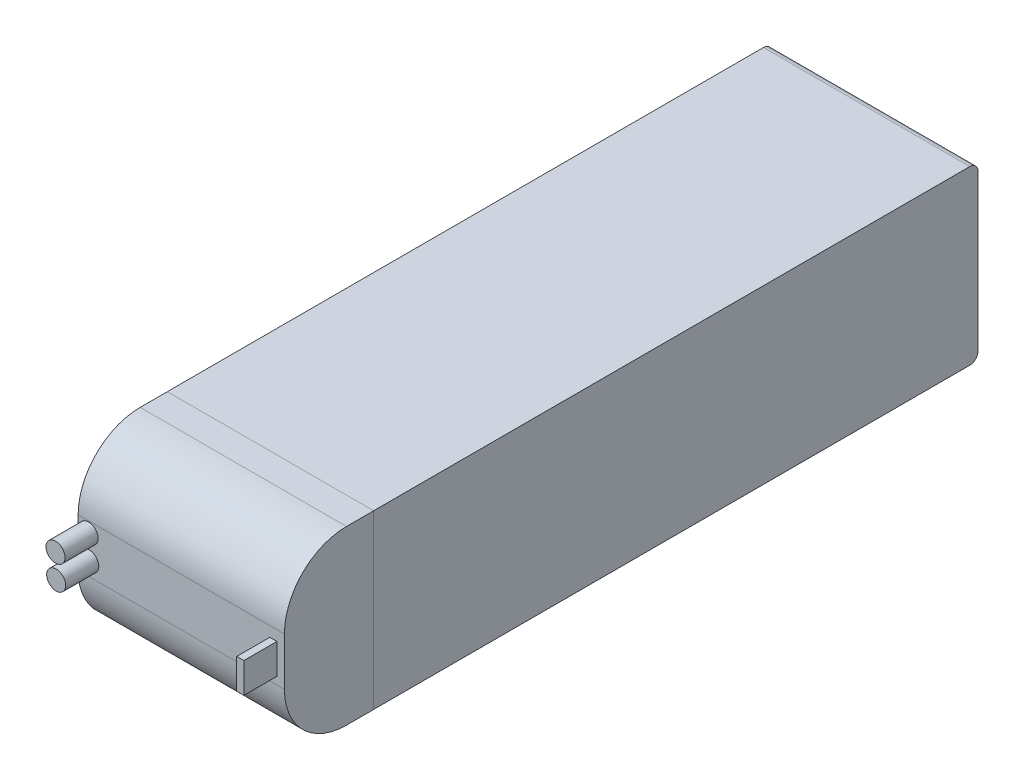
ISO-10303-21;
HEADER;
FILE_DESCRIPTION(('STEP AP214'),'2;1');
FILE_NAME('part.step','',(''),(''),'','','');
FILE_SCHEMA(('AUTOMOTIVE_DESIGN { 1 0 10303 214 1 1 1 1 }'));
ENDSEC;
DATA;
#1=APPLICATION_CONTEXT('core data for automotive mechanical design processes');
#2=APPLICATION_PROTOCOL_DEFINITION('international standard','automotive_design',2000,#1);
#3=PRODUCT_CONTEXT('',#1,'mechanical');
#4=PRODUCT('Part','Part','',(#3));
#5=PRODUCT_RELATED_PRODUCT_CATEGORY('part','',(#4));
#6=PRODUCT_DEFINITION_FORMATION('','',#4);
#7=PRODUCT_DEFINITION_CONTEXT('part definition',#1,'design');
#8=PRODUCT_DEFINITION('design','',#6,#7);
#9=PRODUCT_DEFINITION_SHAPE('','',#8);
#10=(LENGTH_UNIT() NAMED_UNIT(*) SI_UNIT(.MILLI.,.METRE.));
#11=(NAMED_UNIT(*) PLANE_ANGLE_UNIT() SI_UNIT($,.RADIAN.));
#12=(NAMED_UNIT(*) SI_UNIT($,.STERADIAN.) SOLID_ANGLE_UNIT());
#13=UNCERTAINTY_MEASURE_WITH_UNIT(LENGTH_MEASURE(1.E-05),#10,'distance_accuracy_value','');
#14=(GEOMETRIC_REPRESENTATION_CONTEXT(3) GLOBAL_UNCERTAINTY_ASSIGNED_CONTEXT((#13)) GLOBAL_UNIT_ASSIGNED_CONTEXT((#10,
#11,#12)) REPRESENTATION_CONTEXT('',''));
#15=CARTESIAN_POINT('',(0.,0.,0.));
#16=DIRECTION('',(0.,0.,1.));
#17=DIRECTION('',(1.,0.,0.));
#18=AXIS2_PLACEMENT_3D('',#15,#16,#17);
#19=CARTESIAN_POINT('',(0.,0.,94.625));
#20=DIRECTION('',(0.,0.,1.));
#21=DIRECTION('',(1.,0.,0.));
#22=AXIS2_PLACEMENT_3D('',#19,#20,#21);
#23=PLANE('',#22);
#24=CARTESIAN_POINT('',(-22.2263601289547,18.3127947682551,94.625));
#25=DIRECTION('',(0.,0.,1.));
#26=DIRECTION('',(1.,0.,0.));
#27=AXIS2_PLACEMENT_3D('',#24,#25,#26);
#28=CIRCLE('',#27,2.305);
#29=CARTESIAN_POINT('',(-19.9213601289547,18.3127947682551,94.625));
#30=VERTEX_POINT('',#29);
#31=EDGE_CURVE('E195',#30,#30,#28,.T.);
#32=ORIENTED_EDGE('',*,*,#31,.F.);
#33=EDGE_LOOP('',(#32));
#34=FACE_BOUND('',#33,.T.);
#35=CARTESIAN_POINT('',(-22.3821375346887,24.0765587804127,94.625));
#36=DIRECTION('',(0.,0.,1.));
#37=DIRECTION('',(1.,0.,0.));
#38=AXIS2_PLACEMENT_3D('',#35,#36,#37);
#39=CIRCLE('',#38,2.305);
#40=CARTESIAN_POINT('',(-20.0771375346887,24.0765587804127,94.625));
#41=VERTEX_POINT('',#40);
#42=EDGE_CURVE('E208',#41,#41,#39,.T.);
#43=ORIENTED_EDGE('',*,*,#42,.F.);
#44=EDGE_LOOP('',(#43));
#45=FACE_BOUND('',#44,.T.);
#46=DIRECTION('',(0.,-1.,0.));
#47=VECTOR('',#46,1.);
#48=CARTESIAN_POINT('',(-24.913270920856,0.0104665199967546,94.625));
#49=LINE('',#48,#47);
#50=CARTESIAN_POINT('',(-24.913270920856,26.6104665199968,94.625));
#51=VERTEX_POINT('',#50);
#52=CARTESIAN_POINT('',(-24.913270920856,15.0104665199968,94.625));
#53=VERTEX_POINT('',#52);
#54=EDGE_CURVE('E218',#51,#53,#49,.T.);
#55=ORIENTED_EDGE('',*,*,#54,.T.);
#56=DIRECTION('',(1.,0.,0.));
#57=VECTOR('',#56,1.);
#58=CARTESIAN_POINT('',(24.956729079144,15.0104665199968,94.625));
#59=LINE('',#58,#57);
#60=CARTESIAN_POINT('',(24.956729079144,15.0104665199968,94.625));
#61=VERTEX_POINT('',#60);
#62=EDGE_CURVE('E296',#53,#61,#59,.T.);
#63=ORIENTED_EDGE('',*,*,#62,.T.);
#64=DIRECTION('',(0.,1.,0.));
#65=VECTOR('',#64,1.);
#66=CARTESIAN_POINT('',(24.956729079144,0.0104665199967607,94.625));
#67=LINE('',#66,#65);
#68=CARTESIAN_POINT('',(24.956729079144,26.6104665199968,94.625));
#69=VERTEX_POINT('',#68);
#70=EDGE_CURVE('E222',#61,#69,#67,.T.);
#71=ORIENTED_EDGE('',*,*,#70,.T.);
#72=DIRECTION('',(-1.,0.,0.));
#73=VECTOR('',#72,1.);
#74=CARTESIAN_POINT('',(-24.913270920856,26.6104665199968,94.625));
#75=LINE('',#74,#73);
#76=EDGE_CURVE('E292',#69,#51,#75,.T.);
#77=ORIENTED_EDGE('',*,*,#76,.T.);
#78=EDGE_LOOP('',(#55,#63,#71,#77));
#79=FACE_BOUND('',#78,.T.);
#80=DIRECTION('',(-1.,0.,0.));
#81=VECTOR('',#80,1.);
#82=CARTESIAN_POINT('',(21.4270335595322,24.143678448531,94.625));
#83=LINE('',#82,#81);
#84=CARTESIAN_POINT('',(23.1470335595322,24.143678448531,94.625));
#85=VERTEX_POINT('',#84);
#86=CARTESIAN_POINT('',(21.4270335595322,24.143678448531,94.625));
#87=VERTEX_POINT('',#86);
#88=EDGE_CURVE('E445',#85,#87,#83,.T.);
#89=ORIENTED_EDGE('',*,*,#88,.F.);
#90=DIRECTION('',(0.,1.,0.));
#91=VECTOR('',#90,1.);
#92=CARTESIAN_POINT('',(23.1470335595322,24.143678448531,94.625));
#93=LINE('',#92,#91);
#94=CARTESIAN_POINT('',(23.1470335595322,16.843678448531,94.625));
#95=VERTEX_POINT('',#94);
#96=EDGE_CURVE('E192',#95,#85,#93,.T.);
#97=ORIENTED_EDGE('',*,*,#96,.F.);
#98=DIRECTION('',(1.,0.,0.));
#99=VECTOR('',#98,1.);
#100=CARTESIAN_POINT('',(21.4270335595322,16.843678448531,94.625));
#101=LINE('',#100,#99);
#102=CARTESIAN_POINT('',(21.4270335595322,16.843678448531,94.625));
#103=VERTEX_POINT('',#102);
#104=EDGE_CURVE('E188',#103,#95,#101,.T.);
#105=ORIENTED_EDGE('',*,*,#104,.F.);
#106=DIRECTION('',(0.,-1.,0.));
#107=VECTOR('',#106,1.);
#108=CARTESIAN_POINT('',(21.4270335595322,24.143678448531,94.625));
#109=LINE('',#108,#107);
#110=EDGE_CURVE('E448',#87,#103,#109,.T.);
#111=ORIENTED_EDGE('',*,*,#110,.F.);
#112=EDGE_LOOP('',(#89,#97,#105,#111));
#113=FACE_BOUND('',#112,.T.);
#114=ADVANCED_FACE('F43',(#34,#45,#79,#113),#23,.T.);
#115=CARTESIAN_POINT('',(24.935,41.6,73.055));
#116=DIRECTION('',(0.,0.,-1.));
#117=DIRECTION('',(-1.,0.,0.));
#118=AXIS2_PLACEMENT_3D('',#115,#116,#117);
#119=PLANE('',#118);
#120=DIRECTION('',(0.,-1.,0.));
#121=VECTOR('',#120,1.);
#122=CARTESIAN_POINT('',(-24.913270920856,0.0104665199967546,73.055));
#123=LINE('',#122,#121);
#124=CARTESIAN_POINT('',(-24.913270920856,41.6,73.055));
#125=VERTEX_POINT('',#124);
#126=CARTESIAN_POINT('',(-24.913270920856,0.0104665199967546,73.055));
#127=VERTEX_POINT('',#126);
#128=EDGE_CURVE('E232',#125,#127,#123,.T.);
#129=ORIENTED_EDGE('',*,*,#128,.F.);
#130=DIRECTION('',(1.,0.,0.));
#131=VECTOR('',#130,1.);
#132=CARTESIAN_POINT('',(24.935,41.6,73.055));
#133=LINE('',#132,#131);
#134=CARTESIAN_POINT('',(-24.935,41.6,73.055));
#135=VERTEX_POINT('',#134);
#136=EDGE_CURVE('E261',#135,#125,#133,.T.);
#137=ORIENTED_EDGE('',*,*,#136,.F.);
#138=DIRECTION('',(0.,-1.,0.));
#139=VECTOR('',#138,1.);
#140=CARTESIAN_POINT('',(-24.935,41.6,73.055));
#141=LINE('',#140,#139);
#142=CARTESIAN_POINT('',(-24.935,0.,73.055));
#143=VERTEX_POINT('',#142);
#144=EDGE_CURVE('E288',#135,#143,#141,.T.);
#145=ORIENTED_EDGE('',*,*,#144,.T.);
#146=DIRECTION('',(1.,0.,0.));
#147=VECTOR('',#146,1.);
#148=CARTESIAN_POINT('',(24.935,0.,73.055));
#149=LINE('',#148,#147);
#150=CARTESIAN_POINT('',(24.935,0.,73.055));
#151=VERTEX_POINT('',#150);
#152=EDGE_CURVE('E271',#143,#151,#149,.T.);
#153=ORIENTED_EDGE('',*,*,#152,.T.);
#154=DIRECTION('',(0.,-1.,0.));
#155=VECTOR('',#154,1.);
#156=CARTESIAN_POINT('',(24.935,41.6,73.055));
#157=LINE('',#156,#155);
#158=CARTESIAN_POINT('',(24.935,0.0104665199967607,73.055));
#159=VERTEX_POINT('',#158);
#160=EDGE_CURVE('E284',#159,#151,#157,.T.);
#161=ORIENTED_EDGE('',*,*,#160,.F.);
#162=DIRECTION('',(1.,0.,0.));
#163=VECTOR('',#162,1.);
#164=CARTESIAN_POINT('',(24.956729079144,0.0104665199967607,73.055));
#165=LINE('',#164,#163);
#166=EDGE_CURVE('E233',#127,#159,#165,.T.);
#167=ORIENTED_EDGE('',*,*,#166,.F.);
#168=EDGE_LOOP('',(#129,#137,#145,#153,#161,#167));
#169=FACE_BOUND('',#168,.T.);
#170=ADVANCED_FACE('F352',(#169),#119,.F.);
#171=CARTESIAN_POINT('',(-24.935,41.6,73.055));
#172=DIRECTION('',(1.,0.,0.));
#173=DIRECTION('',(0.,0.,-1.));
#174=AXIS2_PLACEMENT_3D('',#171,#172,#173);
#175=PLANE('',#174);
#176=DIRECTION('',(0.,-1.,0.));
#177=VECTOR('',#176,1.);
#178=CARTESIAN_POINT('',(-24.935,41.6,-73.055));
#179=LINE('',#178,#177);
#180=CARTESIAN_POINT('',(-24.935,39.6,-73.055));
#181=VERTEX_POINT('',#180);
#182=CARTESIAN_POINT('',(-24.935,2.,-73.055));
#183=VERTEX_POINT('',#182);
#184=EDGE_CURVE('E268',#181,#183,#179,.T.);
#185=ORIENTED_EDGE('',*,*,#184,.T.);
#186=CARTESIAN_POINT('',(-24.935,2.,-71.055));
#187=DIRECTION('',(1.,0.,0.));
#188=DIRECTION('',(0.,0.,-1.));
#189=AXIS2_PLACEMENT_3D('',#186,#187,#188);
#190=CIRCLE('',#189,2.);
#191=CARTESIAN_POINT('',(-24.935,0.,-71.055));
#192=VERTEX_POINT('',#191);
#193=EDGE_CURVE('E328',#183,#192,#190,.F.);
#194=ORIENTED_EDGE('',*,*,#193,.T.);
#195=DIRECTION('',(0.,0.,1.));
#196=VECTOR('',#195,1.);
#197=CARTESIAN_POINT('',(-24.935,0.,73.055));
#198=LINE('',#197,#196);
#199=EDGE_CURVE('E255',#192,#143,#198,.T.);
#200=ORIENTED_EDGE('',*,*,#199,.T.);
#201=ORIENTED_EDGE('',*,*,#144,.F.);
#202=DIRECTION('',(0.,0.,1.));
#203=VECTOR('',#202,1.);
#204=CARTESIAN_POINT('',(-24.935,41.6,73.055));
#205=LINE('',#204,#203);
#206=CARTESIAN_POINT('',(-24.935,41.6,-71.055));
#207=VERTEX_POINT('',#206);
#208=EDGE_CURVE('E256',#207,#135,#205,.T.);
#209=ORIENTED_EDGE('',*,*,#208,.F.);
#210=CARTESIAN_POINT('',(-24.935,39.6,-71.055));
#211=DIRECTION('',(1.,0.,0.));
#212=DIRECTION('',(0.,0.,-1.));
#213=AXIS2_PLACEMENT_3D('',#210,#211,#212);
#214=CIRCLE('',#213,2.);
#215=EDGE_CURVE('E325',#207,#181,#214,.F.);
#216=ORIENTED_EDGE('',*,*,#215,.T.);
#217=EDGE_LOOP('',(#185,#194,#200,#201,#209,#216));
#218=FACE_BOUND('',#217,.T.);
#219=ADVANCED_FACE('F345',(#218),#175,.F.);
#220=CARTESIAN_POINT('',(24.935,41.6,73.055));
#221=DIRECTION('',(-1.,0.,0.));
#222=DIRECTION('',(0.,0.,1.));
#223=AXIS2_PLACEMENT_3D('',#220,#221,#222);
#224=PLANE('',#223);
#225=DIRECTION('',(0.,0.,-1.));
#226=VECTOR('',#225,1.);
#227=CARTESIAN_POINT('',(24.935,0.,73.055));
#228=LINE('',#227,#226);
#229=CARTESIAN_POINT('',(24.935,0.,-71.055));
#230=VERTEX_POINT('',#229);
#231=EDGE_CURVE('E260',#151,#230,#228,.T.);
#232=ORIENTED_EDGE('',*,*,#231,.T.);
#233=CARTESIAN_POINT('',(24.935,2.,-71.055));
#234=DIRECTION('',(-1.,0.,0.));
#235=DIRECTION('',(0.,0.,1.));
#236=AXIS2_PLACEMENT_3D('',#233,#234,#235);
#237=CIRCLE('',#236,2.);
#238=CARTESIAN_POINT('',(24.935,2.,-73.055));
#239=VERTEX_POINT('',#238);
#240=EDGE_CURVE('E52',#230,#239,#237,.F.);
#241=ORIENTED_EDGE('',*,*,#240,.T.);
#242=DIRECTION('',(0.,-1.,0.));
#243=VECTOR('',#242,1.);
#244=CARTESIAN_POINT('',(24.935,41.6,-73.055));
#245=LINE('',#244,#243);
#246=CARTESIAN_POINT('',(24.935,39.6,-73.055));
#247=VERTEX_POINT('',#246);
#248=EDGE_CURVE('E280',#247,#239,#245,.T.);
#249=ORIENTED_EDGE('',*,*,#248,.F.);
#250=CARTESIAN_POINT('',(24.935,39.6,-71.055));
#251=DIRECTION('',(-1.,0.,0.));
#252=DIRECTION('',(0.,0.,1.));
#253=AXIS2_PLACEMENT_3D('',#250,#251,#252);
#254=CIRCLE('',#253,2.);
#255=CARTESIAN_POINT('',(24.935,41.6,-71.055));
#256=VERTEX_POINT('',#255);
#257=EDGE_CURVE('E59',#247,#256,#254,.F.);
#258=ORIENTED_EDGE('',*,*,#257,.T.);
#259=DIRECTION('',(0.,0.,-1.));
#260=VECTOR('',#259,1.);
#261=CARTESIAN_POINT('',(24.935,41.6,73.055));
#262=LINE('',#261,#260);
#263=CARTESIAN_POINT('',(24.935,41.6,73.055));
#264=VERTEX_POINT('',#263);
#265=EDGE_CURVE('E265',#264,#256,#262,.T.);
#266=ORIENTED_EDGE('',*,*,#265,.F.);
#267=EDGE_CURVE('E285',#264,#159,#157,.T.);
#268=ORIENTED_EDGE('',*,*,#267,.T.);
#269=ORIENTED_EDGE('',*,*,#160,.T.);
#270=EDGE_LOOP('',(#232,#241,#249,#258,#266,#268,#269));
#271=FACE_BOUND('',#270,.T.);
#272=ADVANCED_FACE('F336',(#271),#224,.F.);
#273=CARTESIAN_POINT('',(24.935,41.6,-73.055));
#274=DIRECTION('',(0.,0.,1.));
#275=DIRECTION('',(1.,0.,0.));
#276=AXIS2_PLACEMENT_3D('',#273,#274,#275);
#277=PLANE('',#276);
#278=ORIENTED_EDGE('',*,*,#248,.T.);
#279=DIRECTION('',(-1.,0.,0.));
#280=VECTOR('',#279,1.);
#281=CARTESIAN_POINT('',(24.935,2.,-73.055));
#282=LINE('',#281,#280);
#283=EDGE_CURVE('E321',#239,#183,#282,.T.);
#284=ORIENTED_EDGE('',*,*,#283,.T.);
#285=ORIENTED_EDGE('',*,*,#184,.F.);
#286=DIRECTION('',(-1.,0.,0.));
#287=VECTOR('',#286,1.);
#288=CARTESIAN_POINT('',(24.935,39.6,-73.055));
#289=LINE('',#288,#287);
#290=EDGE_CURVE('E318',#181,#247,#289,.F.);
#291=ORIENTED_EDGE('',*,*,#290,.T.);
#292=EDGE_LOOP('',(#278,#284,#285,#291));
#293=FACE_BOUND('',#292,.T.);
#294=ADVANCED_FACE('F340',(#293),#277,.F.);
#295=CARTESIAN_POINT('',(0.,41.6,0.));
#296=DIRECTION('',(0.,1.,0.));
#297=DIRECTION('',(0.,0.,1.));
#298=AXIS2_PLACEMENT_3D('',#295,#296,#297);
#299=PLANE('',#298);
#300=ORIENTED_EDGE('',*,*,#265,.T.);
#301=DIRECTION('',(-1.,0.,0.));
#302=VECTOR('',#301,1.);
#303=CARTESIAN_POINT('',(-24.935,41.6,-71.055));
#304=LINE('',#303,#302);
#305=EDGE_CURVE('E11',#256,#207,#304,.T.);
#306=ORIENTED_EDGE('',*,*,#305,.T.);
#307=ORIENTED_EDGE('',*,*,#208,.T.);
#308=ORIENTED_EDGE('',*,*,#136,.T.);
#309=EDGE_CURVE('E259',#125,#264,#133,.T.);
#310=ORIENTED_EDGE('',*,*,#309,.T.);
#311=EDGE_LOOP('',(#300,#306,#307,#308,#310));
#312=FACE_BOUND('',#311,.T.);
#313=ADVANCED_FACE('F355',(#312),#299,.T.);
#314=CARTESIAN_POINT('',(0.,0.,0.));
#315=DIRECTION('',(0.,1.,0.));
#316=DIRECTION('',(0.,0.,1.));
#317=AXIS2_PLACEMENT_3D('',#314,#315,#316);
#318=PLANE('',#317);
#319=ORIENTED_EDGE('',*,*,#199,.F.);
#320=DIRECTION('',(-1.,0.,0.));
#321=VECTOR('',#320,1.);
#322=CARTESIAN_POINT('',(0.,0.,-71.055));
#323=LINE('',#322,#321);
#324=EDGE_CURVE('E67',#192,#230,#323,.F.);
#325=ORIENTED_EDGE('',*,*,#324,.T.);
#326=ORIENTED_EDGE('',*,*,#231,.F.);
#327=ORIENTED_EDGE('',*,*,#152,.F.);
#328=EDGE_LOOP('',(#319,#325,#326,#327));
#329=FACE_BOUND('',#328,.T.);
#330=ADVANCED_FACE('F348',(#329),#318,.F.);
#331=CARTESIAN_POINT('',(-24.913270920856,0.0104665199967546,94.625));
#332=DIRECTION('',(1.,0.,0.));
#333=DIRECTION('',(0.,0.,-1.));
#334=AXIS2_PLACEMENT_3D('',#331,#332,#333);
#335=PLANE('',#334);
#336=DIRECTION('',(0.,0.,-1.));
#337=VECTOR('',#336,1.);
#338=CARTESIAN_POINT('',(-24.913270920856,0.0104665199967546,94.625));
#339=LINE('',#338,#337);
#340=CARTESIAN_POINT('',(-24.913270920856,0.0104665199967546,79.625));
#341=VERTEX_POINT('',#340);
#342=EDGE_CURVE('E252',#341,#127,#339,.T.);
#343=ORIENTED_EDGE('',*,*,#342,.F.);
#344=CARTESIAN_POINT('',(-24.913270920856,15.0104665199968,79.625));
#345=DIRECTION('',(1.,0.,0.));
#346=DIRECTION('',(0.,0.,-1.));
#347=AXIS2_PLACEMENT_3D('',#344,#345,#346);
#348=CIRCLE('',#347,15.);
#349=EDGE_CURVE('E312',#341,#53,#348,.F.);
#350=ORIENTED_EDGE('',*,*,#349,.T.);
#351=ORIENTED_EDGE('',*,*,#54,.F.);
#352=CARTESIAN_POINT('',(-24.913270920856,26.6104665199968,79.625));
#353=DIRECTION('',(1.,0.,0.));
#354=DIRECTION('',(0.,0.,-1.));
#355=AXIS2_PLACEMENT_3D('',#352,#353,#354);
#356=CIRCLE('',#355,15.);
#357=CARTESIAN_POINT('',(-24.913270920856,41.6104665199968,79.625));
#358=VERTEX_POINT('',#357);
#359=EDGE_CURVE('E309',#51,#358,#356,.F.);
#360=ORIENTED_EDGE('',*,*,#359,.T.);
#361=DIRECTION('',(0.,0.,-1.));
#362=VECTOR('',#361,1.);
#363=CARTESIAN_POINT('',(-24.913270920856,41.6104665199968,94.625));
#364=LINE('',#363,#362);
#365=CARTESIAN_POINT('',(-24.913270920856,41.6104665199968,73.055));
#366=VERTEX_POINT('',#365);
#367=EDGE_CURVE('E227',#358,#366,#364,.T.);
#368=ORIENTED_EDGE('',*,*,#367,.T.);
#369=EDGE_CURVE('E214',#366,#125,#123,.T.);
#370=ORIENTED_EDGE('',*,*,#369,.T.);
#371=ORIENTED_EDGE('',*,*,#128,.T.);
#372=EDGE_LOOP('',(#343,#350,#351,#360,#368,#370,#371));
#373=FACE_BOUND('',#372,.T.);
#374=ADVANCED_FACE('F392',(#373),#335,.F.);
#375=CARTESIAN_POINT('',(24.956729079144,0.0104665199967607,94.625));
#376=DIRECTION('',(0.,1.,0.));
#377=DIRECTION('',(-1.,0.,0.));
#378=AXIS2_PLACEMENT_3D('',#375,#376,#377);
#379=PLANE('',#378);
#380=DIRECTION('',(0.,0.,-1.));
#381=VECTOR('',#380,1.);
#382=CARTESIAN_POINT('',(24.956729079144,0.0104665199967607,94.625));
#383=LINE('',#382,#381);
#384=CARTESIAN_POINT('',(24.956729079144,0.0104665199967607,79.625));
#385=VERTEX_POINT('',#384);
#386=CARTESIAN_POINT('',(24.956729079144,0.0104665199967607,73.055));
#387=VERTEX_POINT('',#386);
#388=EDGE_CURVE('E249',#385,#387,#383,.T.);
#389=ORIENTED_EDGE('',*,*,#388,.F.);
#390=DIRECTION('',(1.,0.,0.));
#391=VECTOR('',#390,1.);
#392=CARTESIAN_POINT('',(-24.913270920856,0.0104665199967546,79.625));
#393=LINE('',#392,#391);
#394=EDGE_CURVE('E306',#385,#341,#393,.F.);
#395=ORIENTED_EDGE('',*,*,#394,.T.);
#396=ORIENTED_EDGE('',*,*,#342,.T.);
#397=ORIENTED_EDGE('',*,*,#166,.T.);
#398=EDGE_CURVE('E231',#159,#387,#165,.T.);
#399=ORIENTED_EDGE('',*,*,#398,.T.);
#400=EDGE_LOOP('',(#389,#395,#396,#397,#399));
#401=FACE_BOUND('',#400,.T.);
#402=ADVANCED_FACE('F388',(#401),#379,.F.);
#403=CARTESIAN_POINT('',(24.956729079144,0.0104665199967607,94.625));
#404=DIRECTION('',(-1.,0.,0.));
#405=DIRECTION('',(0.,0.,1.));
#406=AXIS2_PLACEMENT_3D('',#403,#404,#405);
#407=PLANE('',#406);
#408=ORIENTED_EDGE('',*,*,#70,.F.);
#409=CARTESIAN_POINT('',(24.956729079144,15.0104665199968,79.625));
#410=DIRECTION('',(-1.,0.,0.));
#411=DIRECTION('',(0.,0.,1.));
#412=AXIS2_PLACEMENT_3D('',#409,#410,#411);
#413=CIRCLE('',#412,15.);
#414=EDGE_CURVE('E303',#61,#385,#413,.F.);
#415=ORIENTED_EDGE('',*,*,#414,.T.);
#416=ORIENTED_EDGE('',*,*,#388,.T.);
#417=DIRECTION('',(0.,1.,0.));
#418=VECTOR('',#417,1.);
#419=CARTESIAN_POINT('',(24.956729079144,0.0104665199967607,73.055));
#420=LINE('',#419,#418);
#421=CARTESIAN_POINT('',(24.956729079144,41.6104665199968,73.055));
#422=VERTEX_POINT('',#421);
#423=EDGE_CURVE('E237',#387,#422,#420,.T.);
#424=ORIENTED_EDGE('',*,*,#423,.T.);
#425=DIRECTION('',(0.,0.,-1.));
#426=VECTOR('',#425,1.);
#427=CARTESIAN_POINT('',(24.956729079144,41.6104665199968,94.625));
#428=LINE('',#427,#426);
#429=CARTESIAN_POINT('',(24.956729079144,41.6104665199968,79.625));
#430=VERTEX_POINT('',#429);
#431=EDGE_CURVE('E246',#430,#422,#428,.T.);
#432=ORIENTED_EDGE('',*,*,#431,.F.);
#433=CARTESIAN_POINT('',(24.956729079144,26.6104665199968,79.625));
#434=DIRECTION('',(-1.,0.,0.));
#435=DIRECTION('',(0.,0.,1.));
#436=AXIS2_PLACEMENT_3D('',#433,#434,#435);
#437=CIRCLE('',#436,15.);
#438=EDGE_CURVE('E300',#430,#69,#437,.F.);
#439=ORIENTED_EDGE('',*,*,#438,.T.);
#440=EDGE_LOOP('',(#408,#415,#416,#424,#432,#439));
#441=FACE_BOUND('',#440,.T.);
#442=ADVANCED_FACE('F384',(#441),#407,.F.);
#443=CARTESIAN_POINT('',(24.956729079144,41.6104665199968,94.625));
#444=DIRECTION('',(0.,-1.,0.));
#445=DIRECTION('',(1.,0.,0.));
#446=AXIS2_PLACEMENT_3D('',#443,#444,#445);
#447=PLANE('',#446);
#448=ORIENTED_EDGE('',*,*,#367,.F.);
#449=DIRECTION('',(-1.,0.,0.));
#450=VECTOR('',#449,1.);
#451=CARTESIAN_POINT('',(24.956729079144,41.6104665199968,79.625));
#452=LINE('',#451,#450);
#453=EDGE_CURVE('E315',#358,#430,#452,.F.);
#454=ORIENTED_EDGE('',*,*,#453,.T.);
#455=ORIENTED_EDGE('',*,*,#431,.T.);
#456=DIRECTION('',(-1.,0.,0.));
#457=VECTOR('',#456,1.);
#458=CARTESIAN_POINT('',(24.956729079144,41.6104665199968,73.055));
#459=LINE('',#458,#457);
#460=EDGE_CURVE('E223',#422,#366,#459,.T.);
#461=ORIENTED_EDGE('',*,*,#460,.T.);
#462=EDGE_LOOP('',(#448,#454,#455,#461));
#463=FACE_BOUND('',#462,.T.);
#464=ADVANCED_FACE('F380',(#463),#447,.F.);
#465=CARTESIAN_POINT('',(0.,0.,73.055));
#466=DIRECTION('',(0.,0.,1.));
#467=DIRECTION('',(1.,0.,0.));
#468=AXIS2_PLACEMENT_3D('',#465,#466,#467);
#469=PLANE('',#468);
#470=ORIENTED_EDGE('',*,*,#267,.F.);
#471=ORIENTED_EDGE('',*,*,#309,.F.);
#472=ORIENTED_EDGE('',*,*,#369,.F.);
#473=ORIENTED_EDGE('',*,*,#460,.F.);
#474=ORIENTED_EDGE('',*,*,#423,.F.);
#475=ORIENTED_EDGE('',*,*,#398,.F.);
#476=EDGE_LOOP('',(#470,#471,#472,#473,#474,#475));
#477=FACE_BOUND('',#476,.T.);
#478=ADVANCED_FACE('F376',(#477),#469,.F.);
#479=CARTESIAN_POINT('',(0.,15.0104665199968,79.625));
#480=DIRECTION('',(-1.,0.,0.));
#481=DIRECTION('',(0.,-1.,0.));
#482=AXIS2_PLACEMENT_3D('',#479,#480,#481);
#483=CYLINDRICAL_SURFACE('',#482,15.);
#484=ORIENTED_EDGE('',*,*,#349,.F.);
#485=ORIENTED_EDGE('',*,*,#394,.F.);
#486=ORIENTED_EDGE('',*,*,#414,.F.);
#487=ORIENTED_EDGE('',*,*,#62,.F.);
#488=EDGE_LOOP('',(#484,#485,#486,#487));
#489=FACE_BOUND('',#488,.T.);
#490=ADVANCED_FACE('F379',(#489),#483,.T.);
#491=CARTESIAN_POINT('',(0.,26.6104665199968,79.625));
#492=DIRECTION('',(1.,0.,0.));
#493=DIRECTION('',(0.,1.,0.));
#494=AXIS2_PLACEMENT_3D('',#491,#492,#493);
#495=CYLINDRICAL_SURFACE('',#494,15.);
#496=ORIENTED_EDGE('',*,*,#438,.F.);
#497=ORIENTED_EDGE('',*,*,#453,.F.);
#498=ORIENTED_EDGE('',*,*,#359,.F.);
#499=ORIENTED_EDGE('',*,*,#76,.F.);
#500=EDGE_LOOP('',(#496,#497,#498,#499));
#501=FACE_BOUND('',#500,.T.);
#502=ADVANCED_FACE('F409',(#501),#495,.T.);
#503=CARTESIAN_POINT('',(-22.3821375346887,24.0765587804127,102.625));
#504=DIRECTION('',(0.,0.,-1.));
#505=DIRECTION('',(-1.,0.,0.));
#506=AXIS2_PLACEMENT_3D('',#503,#504,#505);
#507=CYLINDRICAL_SURFACE('',#506,2.305);
#508=CARTESIAN_POINT('',(-22.3821375346887,24.0765587804127,102.625));
#509=DIRECTION('',(0.,0.,1.));
#510=DIRECTION('',(1.,0.,0.));
#511=AXIS2_PLACEMENT_3D('',#508,#509,#510);
#512=CIRCLE('',#511,2.305);
#513=CARTESIAN_POINT('',(-20.0771375346887,24.0765587804127,102.625));
#514=VERTEX_POINT('',#513);
#515=EDGE_CURVE('E210',#514,#514,#512,.T.);
#516=ORIENTED_EDGE('',*,*,#515,.F.);
#517=EDGE_LOOP('',(#516));
#518=FACE_BOUND('',#517,.T.);
#519=ORIENTED_EDGE('',*,*,#42,.T.);
#520=EDGE_LOOP('',(#519));
#521=FACE_BOUND('',#520,.T.);
#522=ADVANCED_FACE('F374',(#518,#521),#507,.T.);
#523=CARTESIAN_POINT('',(-22.3821375346887,24.0765587804127,102.625));
#524=DIRECTION('',(0.,0.,1.));
#525=DIRECTION('',(1.,0.,0.));
#526=AXIS2_PLACEMENT_3D('',#523,#524,#525);
#527=PLANE('',#526);
#528=ORIENTED_EDGE('',*,*,#515,.T.);
#529=EDGE_LOOP('',(#528));
#530=FACE_BOUND('',#529,.T.);
#531=ADVANCED_FACE('F416',(#530),#527,.T.);
#532=CARTESIAN_POINT('',(-22.2263601289547,18.3127947682551,102.625));
#533=DIRECTION('',(0.,0.,-1.));
#534=DIRECTION('',(-1.,0.,0.));
#535=AXIS2_PLACEMENT_3D('',#532,#533,#534);
#536=CYLINDRICAL_SURFACE('',#535,2.305);
#537=CARTESIAN_POINT('',(-22.2263601289547,18.3127947682551,102.625));
#538=DIRECTION('',(0.,0.,1.));
#539=DIRECTION('',(1.,0.,0.));
#540=AXIS2_PLACEMENT_3D('',#537,#538,#539);
#541=CIRCLE('',#540,2.305);
#542=CARTESIAN_POINT('',(-19.9213601289547,18.3127947682551,102.625));
#543=VERTEX_POINT('',#542);
#544=EDGE_CURVE('E200',#543,#543,#541,.T.);
#545=ORIENTED_EDGE('',*,*,#544,.F.);
#546=EDGE_LOOP('',(#545));
#547=FACE_BOUND('',#546,.T.);
#548=ORIENTED_EDGE('',*,*,#31,.T.);
#549=EDGE_LOOP('',(#548));
#550=FACE_BOUND('',#549,.T.);
#551=ADVANCED_FACE('F485',(#547,#550),#536,.T.);
#552=CARTESIAN_POINT('',(-22.2263601289547,18.3127947682551,102.625));
#553=DIRECTION('',(0.,0.,1.));
#554=DIRECTION('',(1.,0.,0.));
#555=AXIS2_PLACEMENT_3D('',#552,#553,#554);
#556=PLANE('',#555);
#557=ORIENTED_EDGE('',*,*,#544,.T.);
#558=EDGE_LOOP('',(#557));
#559=FACE_BOUND('',#558,.T.);
#560=ADVANCED_FACE('F482',(#559),#556,.T.);
#561=CARTESIAN_POINT('',(23.1470335595322,24.143678448531,102.625));
#562=DIRECTION('',(-1.,0.,0.));
#563=DIRECTION('',(0.,0.,1.));
#564=AXIS2_PLACEMENT_3D('',#561,#562,#563);
#565=PLANE('',#564);
#566=ORIENTED_EDGE('',*,*,#96,.T.);
#567=DIRECTION('',(0.,0.,-1.));
#568=VECTOR('',#567,1.);
#569=CARTESIAN_POINT('',(23.1470335595322,24.143678448531,102.625));
#570=LINE('',#569,#568);
#571=CARTESIAN_POINT('',(23.1470335595322,24.143678448531,102.625));
#572=VERTEX_POINT('',#571);
#573=EDGE_CURVE('E170',#572,#85,#570,.T.);
#574=ORIENTED_EDGE('',*,*,#573,.F.);
#575=DIRECTION('',(0.,1.,0.));
#576=VECTOR('',#575,1.);
#577=CARTESIAN_POINT('',(23.1470335595322,24.143678448531,102.625));
#578=LINE('',#577,#576);
#579=CARTESIAN_POINT('',(23.1470335595322,16.843678448531,102.625));
#580=VERTEX_POINT('',#579);
#581=EDGE_CURVE('E178',#580,#572,#578,.T.);
#582=ORIENTED_EDGE('',*,*,#581,.F.);
#583=DIRECTION('',(0.,0.,-1.));
#584=VECTOR('',#583,1.);
#585=CARTESIAN_POINT('',(23.1470335595322,16.843678448531,102.625));
#586=LINE('',#585,#584);
#587=EDGE_CURVE('E459',#580,#95,#586,.T.);
#588=ORIENTED_EDGE('',*,*,#587,.T.);
#589=EDGE_LOOP('',(#566,#574,#582,#588));
#590=FACE_BOUND('',#589,.T.);
#591=ADVANCED_FACE('F190',(#590),#565,.F.);
#592=CARTESIAN_POINT('',(21.4270335595322,24.143678448531,102.625));
#593=DIRECTION('',(0.,-1.,0.));
#594=DIRECTION('',(0.,0.,-1.));
#595=AXIS2_PLACEMENT_3D('',#592,#593,#594);
#596=PLANE('',#595);
#597=ORIENTED_EDGE('',*,*,#88,.T.);
#598=DIRECTION('',(0.,0.,-1.));
#599=VECTOR('',#598,1.);
#600=CARTESIAN_POINT('',(21.4270335595322,24.143678448531,102.625));
#601=LINE('',#600,#599);
#602=CARTESIAN_POINT('',(21.4270335595322,24.143678448531,102.625));
#603=VERTEX_POINT('',#602);
#604=EDGE_CURVE('E173',#603,#87,#601,.T.);
#605=ORIENTED_EDGE('',*,*,#604,.F.);
#606=DIRECTION('',(-1.,0.,0.));
#607=VECTOR('',#606,1.);
#608=CARTESIAN_POINT('',(21.4270335595322,24.143678448531,102.625));
#609=LINE('',#608,#607);
#610=EDGE_CURVE('E166',#572,#603,#609,.T.);
#611=ORIENTED_EDGE('',*,*,#610,.F.);
#612=ORIENTED_EDGE('',*,*,#573,.T.);
#613=EDGE_LOOP('',(#597,#605,#611,#612));
#614=FACE_BOUND('',#613,.T.);
#615=ADVANCED_FACE('F168',(#614),#596,.F.);
#616=CARTESIAN_POINT('',(21.4270335595322,24.143678448531,102.625));
#617=DIRECTION('',(1.,0.,0.));
#618=DIRECTION('',(0.,1.,0.));
#619=AXIS2_PLACEMENT_3D('',#616,#617,#618);
#620=PLANE('',#619);
#621=ORIENTED_EDGE('',*,*,#110,.T.);
#622=DIRECTION('',(0.,0.,-1.));
#623=VECTOR('',#622,1.);
#624=CARTESIAN_POINT('',(21.4270335595322,16.843678448531,102.625));
#625=LINE('',#624,#623);
#626=CARTESIAN_POINT('',(21.4270335595322,16.843678448531,102.625));
#627=VERTEX_POINT('',#626);
#628=EDGE_CURVE('E202',#627,#103,#625,.T.);
#629=ORIENTED_EDGE('',*,*,#628,.F.);
#630=DIRECTION('',(0.,-1.,0.));
#631=VECTOR('',#630,1.);
#632=CARTESIAN_POINT('',(21.4270335595322,24.143678448531,102.625));
#633=LINE('',#632,#631);
#634=EDGE_CURVE('E177',#603,#627,#633,.T.);
#635=ORIENTED_EDGE('',*,*,#634,.F.);
#636=ORIENTED_EDGE('',*,*,#604,.T.);
#637=EDGE_LOOP('',(#621,#629,#635,#636));
#638=FACE_BOUND('',#637,.T.);
#639=ADVANCED_FACE('F466',(#638),#620,.F.);
#640=CARTESIAN_POINT('',(21.4270335595322,16.843678448531,102.625));
#641=DIRECTION('',(0.,1.,0.));
#642=DIRECTION('',(0.,0.,1.));
#643=AXIS2_PLACEMENT_3D('',#640,#641,#642);
#644=PLANE('',#643);
#645=ORIENTED_EDGE('',*,*,#104,.T.);
#646=ORIENTED_EDGE('',*,*,#587,.F.);
#647=DIRECTION('',(1.,0.,0.));
#648=VECTOR('',#647,1.);
#649=CARTESIAN_POINT('',(21.4270335595322,16.843678448531,102.625));
#650=LINE('',#649,#648);
#651=EDGE_CURVE('E183',#627,#580,#650,.T.);
#652=ORIENTED_EDGE('',*,*,#651,.F.);
#653=ORIENTED_EDGE('',*,*,#628,.T.);
#654=EDGE_LOOP('',(#645,#646,#652,#653));
#655=FACE_BOUND('',#654,.T.);
#656=ADVANCED_FACE('F464',(#655),#644,.F.);
#657=CARTESIAN_POINT('',(0.,0.,102.625));
#658=DIRECTION('',(0.,0.,1.));
#659=DIRECTION('',(1.,0.,0.));
#660=AXIS2_PLACEMENT_3D('',#657,#658,#659);
#661=PLANE('',#660);
#662=ORIENTED_EDGE('',*,*,#581,.T.);
#663=ORIENTED_EDGE('',*,*,#610,.T.);
#664=ORIENTED_EDGE('',*,*,#634,.T.);
#665=ORIENTED_EDGE('',*,*,#651,.T.);
#666=EDGE_LOOP('',(#662,#663,#664,#665));
#667=FACE_BOUND('',#666,.T.);
#668=ADVANCED_FACE('F181',(#667),#661,.T.);
#669=CARTESIAN_POINT('',(24.935,2.,-71.055));
#670=DIRECTION('',(-1.,0.,0.));
#671=DIRECTION('',(0.,0.,1.));
#672=AXIS2_PLACEMENT_3D('',#669,#670,#671);
#673=CYLINDRICAL_SURFACE('',#672,2.);
#674=ORIENTED_EDGE('',*,*,#240,.F.);
#675=ORIENTED_EDGE('',*,*,#324,.F.);
#676=ORIENTED_EDGE('',*,*,#193,.F.);
#677=ORIENTED_EDGE('',*,*,#283,.F.);
#678=EDGE_LOOP('',(#674,#675,#676,#677));
#679=FACE_BOUND('',#678,.T.);
#680=ADVANCED_FACE('F343',(#679),#673,.T.);
#681=CARTESIAN_POINT('',(0.,39.6,-71.055));
#682=DIRECTION('',(1.,0.,0.));
#683=DIRECTION('',(0.,0.,-1.));
#684=AXIS2_PLACEMENT_3D('',#681,#682,#683);
#685=CYLINDRICAL_SURFACE('',#684,2.);
#686=ORIENTED_EDGE('',*,*,#257,.F.);
#687=ORIENTED_EDGE('',*,*,#290,.F.);
#688=ORIENTED_EDGE('',*,*,#215,.F.);
#689=ORIENTED_EDGE('',*,*,#305,.F.);
#690=EDGE_LOOP('',(#686,#687,#688,#689));
#691=FACE_BOUND('',#690,.T.);
#692=ADVANCED_FACE('F45',(#691),#685,.T.);
#693=CLOSED_SHELL('',(#114,#170,#219,#272,#294,#313,#330,#374,#402,#442,#464,#478,#490,#502,
#522,#531,#551,#560,#591,#615,#639,#656,#668,#680,#692));
#694=MANIFOLD_SOLID_BREP('B2',#693);
#695=ADVANCED_BREP_SHAPE_REPRESENTATION('',(#18,#694),#14);
#696=SHAPE_DEFINITION_REPRESENTATION(#9,#695);
ENDSEC;
END-ISO-10303-21;
